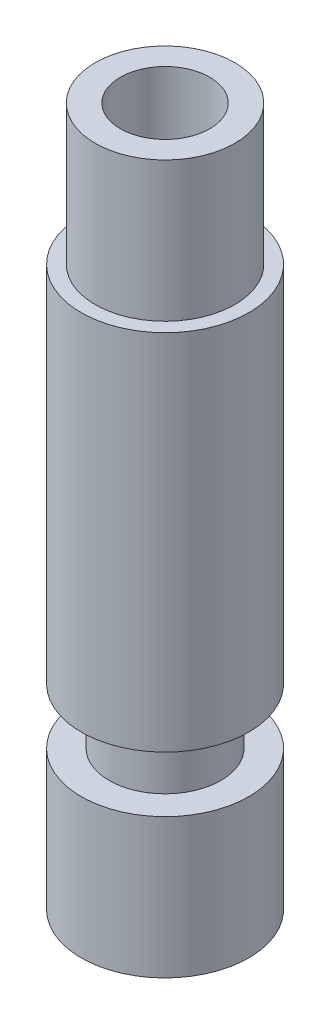
ISO-10303-21;
HEADER;
FILE_DESCRIPTION(('STEP AP214'),'2;1');
FILE_NAME('part.step','',(''),(''),'','','');
FILE_SCHEMA(('AUTOMOTIVE_DESIGN { 1 0 10303 214 1 1 1 1 }'));
ENDSEC;
DATA;
#1=APPLICATION_CONTEXT('core data for automotive mechanical design processes');
#2=APPLICATION_PROTOCOL_DEFINITION('international standard','automotive_design',2000,#1);
#3=PRODUCT_CONTEXT('',#1,'mechanical');
#4=PRODUCT('Part','Part','',(#3));
#5=PRODUCT_RELATED_PRODUCT_CATEGORY('part','',(#4));
#6=PRODUCT_DEFINITION_FORMATION('','',#4);
#7=PRODUCT_DEFINITION_CONTEXT('part definition',#1,'design');
#8=PRODUCT_DEFINITION('design','',#6,#7);
#9=PRODUCT_DEFINITION_SHAPE('','',#8);
#10=(LENGTH_UNIT() NAMED_UNIT(*) SI_UNIT(.MILLI.,.METRE.));
#11=(NAMED_UNIT(*) PLANE_ANGLE_UNIT() SI_UNIT($,.RADIAN.));
#12=(NAMED_UNIT(*) SI_UNIT($,.STERADIAN.) SOLID_ANGLE_UNIT());
#13=UNCERTAINTY_MEASURE_WITH_UNIT(LENGTH_MEASURE(1.E-05),#10,'distance_accuracy_value','');
#14=(GEOMETRIC_REPRESENTATION_CONTEXT(3) GLOBAL_UNCERTAINTY_ASSIGNED_CONTEXT((#13)) GLOBAL_UNIT_ASSIGNED_CONTEXT((#10,
#11,#12)) REPRESENTATION_CONTEXT('',''));
#15=CARTESIAN_POINT('',(0.,0.,0.));
#16=DIRECTION('',(0.,0.,1.));
#17=DIRECTION('',(1.,0.,0.));
#18=AXIS2_PLACEMENT_3D('',#15,#16,#17);
#19=CARTESIAN_POINT('',(3.,0.,0.));
#20=DIRECTION('',(0.,-1.,0.));
#21=DIRECTION('',(0.,0.,-1.));
#22=AXIS2_PLACEMENT_3D('',#19,#20,#21);
#23=PLANE('',#22);
#24=CARTESIAN_POINT('',(0.,0.,0.));
#25=DIRECTION('',(0.,1.,0.));
#26=DIRECTION('',(0.,0.,1.));
#27=AXIS2_PLACEMENT_3D('',#24,#25,#26);
#28=CIRCLE('',#27,1.6);
#29=CARTESIAN_POINT('',(0.,0.,1.6));
#30=VERTEX_POINT('',#29);
#31=EDGE_CURVE('E62',#30,#30,#28,.T.);
#32=ORIENTED_EDGE('',*,*,#31,.T.);
#33=EDGE_LOOP('',(#32));
#34=FACE_BOUND('',#33,.T.);
#35=CARTESIAN_POINT('',(0.,0.,0.));
#36=DIRECTION('',(0.,-1.,0.));
#37=DIRECTION('',(0.,0.,-1.));
#38=AXIS2_PLACEMENT_3D('',#35,#36,#37);
#39=CIRCLE('',#38,3.);
#40=CARTESIAN_POINT('',(0.,0.,-3.));
#41=VERTEX_POINT('',#40);
#42=EDGE_CURVE('E59',#41,#41,#39,.T.);
#43=ORIENTED_EDGE('',*,*,#42,.T.);
#44=EDGE_LOOP('',(#43));
#45=FACE_BOUND('',#44,.T.);
#46=ADVANCED_FACE('F31',(#34,#45),#23,.T.);
#47=CARTESIAN_POINT('',(0.,25.,0.));
#48=DIRECTION('',(0.,1.,0.));
#49=DIRECTION('',(0.,0.,1.));
#50=AXIS2_PLACEMENT_3D('',#47,#48,#49);
#51=PLANE('',#50);
#52=CARTESIAN_POINT('',(0.,25.,0.));
#53=DIRECTION('',(0.,1.,0.));
#54=DIRECTION('',(0.,0.,1.));
#55=AXIS2_PLACEMENT_3D('',#52,#53,#54);
#56=CIRCLE('',#55,1.6);
#57=CARTESIAN_POINT('',(0.,25.,1.6));
#58=VERTEX_POINT('',#57);
#59=EDGE_CURVE('E63',#58,#58,#56,.T.);
#60=ORIENTED_EDGE('',*,*,#59,.F.);
#61=EDGE_LOOP('',(#60));
#62=FACE_BOUND('',#61,.T.);
#63=CARTESIAN_POINT('',(0.,25.,0.));
#64=DIRECTION('',(0.,-1.,0.));
#65=DIRECTION('',(0.,0.,-1.));
#66=AXIS2_PLACEMENT_3D('',#63,#64,#65);
#67=CIRCLE('',#66,2.5);
#68=CARTESIAN_POINT('',(0.,25.,-2.5));
#69=VERTEX_POINT('',#68);
#70=EDGE_CURVE('E10',#69,#69,#67,.T.);
#71=ORIENTED_EDGE('',*,*,#70,.F.);
#72=EDGE_LOOP('',(#71));
#73=FACE_BOUND('',#72,.T.);
#74=ADVANCED_FACE('F78',(#62,#73),#51,.T.);
#75=CARTESIAN_POINT('',(0.,0.,0.));
#76=DIRECTION('',(0.,-1.,0.));
#77=DIRECTION('',(0.,0.,-1.));
#78=AXIS2_PLACEMENT_3D('',#75,#76,#77);
#79=CYLINDRICAL_SURFACE('',#78,2.5);
#80=ORIENTED_EDGE('',*,*,#70,.T.);
#81=EDGE_LOOP('',(#80));
#82=FACE_BOUND('',#81,.T.);
#83=CARTESIAN_POINT('',(0.,20.,0.));
#84=DIRECTION('',(0.,-1.,0.));
#85=DIRECTION('',(0.,0.,-1.));
#86=AXIS2_PLACEMENT_3D('',#83,#84,#85);
#87=CIRCLE('',#86,2.5);
#88=CARTESIAN_POINT('',(0.,20.,-2.5));
#89=VERTEX_POINT('',#88);
#90=EDGE_CURVE('E37',#89,#89,#87,.T.);
#91=ORIENTED_EDGE('',*,*,#90,.F.);
#92=EDGE_LOOP('',(#91));
#93=FACE_BOUND('',#92,.T.);
#94=ADVANCED_FACE('F81',(#82,#93),#79,.T.);
#95=CARTESIAN_POINT('',(2.5,20.,0.));
#96=DIRECTION('',(0.,1.,0.));
#97=DIRECTION('',(0.,0.,1.));
#98=AXIS2_PLACEMENT_3D('',#95,#96,#97);
#99=PLANE('',#98);
#100=ORIENTED_EDGE('',*,*,#90,.T.);
#101=EDGE_LOOP('',(#100));
#102=FACE_BOUND('',#101,.T.);
#103=CARTESIAN_POINT('',(0.,20.,0.));
#104=DIRECTION('',(0.,-1.,0.));
#105=DIRECTION('',(0.,0.,-1.));
#106=AXIS2_PLACEMENT_3D('',#103,#104,#105);
#107=CIRCLE('',#106,3.);
#108=CARTESIAN_POINT('',(0.,20.,-3.));
#109=VERTEX_POINT('',#108);
#110=EDGE_CURVE('E41',#109,#109,#107,.T.);
#111=ORIENTED_EDGE('',*,*,#110,.F.);
#112=EDGE_LOOP('',(#111));
#113=FACE_BOUND('',#112,.T.);
#114=ADVANCED_FACE('F86',(#102,#113),#99,.T.);
#115=CARTESIAN_POINT('',(0.,0.,0.));
#116=DIRECTION('',(0.,-1.,0.));
#117=DIRECTION('',(0.,0.,-1.));
#118=AXIS2_PLACEMENT_3D('',#115,#116,#117);
#119=CYLINDRICAL_SURFACE('',#118,3.);
#120=ORIENTED_EDGE('',*,*,#110,.T.);
#121=EDGE_LOOP('',(#120));
#122=FACE_BOUND('',#121,.T.);
#123=CARTESIAN_POINT('',(0.,7.,0.));
#124=DIRECTION('',(0.,-1.,0.));
#125=DIRECTION('',(0.,0.,-1.));
#126=AXIS2_PLACEMENT_3D('',#123,#124,#125);
#127=CIRCLE('',#126,3.);
#128=CARTESIAN_POINT('',(0.,7.,-3.));
#129=VERTEX_POINT('',#128);
#130=EDGE_CURVE('E45',#129,#129,#127,.T.);
#131=ORIENTED_EDGE('',*,*,#130,.F.);
#132=EDGE_LOOP('',(#131));
#133=FACE_BOUND('',#132,.T.);
#134=ADVANCED_FACE('F91',(#122,#133),#119,.T.);
#135=CARTESIAN_POINT('',(3.,7.,0.));
#136=DIRECTION('',(0.,-1.,0.));
#137=DIRECTION('',(0.,0.,-1.));
#138=AXIS2_PLACEMENT_3D('',#135,#136,#137);
#139=PLANE('',#138);
#140=ORIENTED_EDGE('',*,*,#130,.T.);
#141=EDGE_LOOP('',(#140));
#142=FACE_BOUND('',#141,.T.);
#143=CARTESIAN_POINT('',(0.,7.,0.));
#144=DIRECTION('',(0.,-1.,0.));
#145=DIRECTION('',(0.,0.,-1.));
#146=AXIS2_PLACEMENT_3D('',#143,#144,#145);
#147=CIRCLE('',#146,2.);
#148=CARTESIAN_POINT('',(0.,7.,-2.));
#149=VERTEX_POINT('',#148);
#150=EDGE_CURVE('E50',#149,#149,#147,.T.);
#151=ORIENTED_EDGE('',*,*,#150,.F.);
#152=EDGE_LOOP('',(#151));
#153=FACE_BOUND('',#152,.T.);
#154=ADVANCED_FACE('F94',(#142,#153),#139,.T.);
#155=CARTESIAN_POINT('',(0.,0.,0.));
#156=DIRECTION('',(0.,-1.,0.));
#157=DIRECTION('',(0.,0.,-1.));
#158=AXIS2_PLACEMENT_3D('',#155,#156,#157);
#159=CYLINDRICAL_SURFACE('',#158,2.);
#160=ORIENTED_EDGE('',*,*,#150,.T.);
#161=EDGE_LOOP('',(#160));
#162=FACE_BOUND('',#161,.T.);
#163=CARTESIAN_POINT('',(0.,5.,0.));
#164=DIRECTION('',(0.,-1.,0.));
#165=DIRECTION('',(0.,0.,-1.));
#166=AXIS2_PLACEMENT_3D('',#163,#164,#165);
#167=CIRCLE('',#166,2.);
#168=CARTESIAN_POINT('',(0.,5.,-2.));
#169=VERTEX_POINT('',#168);
#170=EDGE_CURVE('E53',#169,#169,#167,.T.);
#171=ORIENTED_EDGE('',*,*,#170,.F.);
#172=EDGE_LOOP('',(#171));
#173=FACE_BOUND('',#172,.T.);
#174=ADVANCED_FACE('F98',(#162,#173),#159,.T.);
#175=CARTESIAN_POINT('',(2.,5.,0.));
#176=DIRECTION('',(0.,1.,0.));
#177=DIRECTION('',(0.,0.,1.));
#178=AXIS2_PLACEMENT_3D('',#175,#176,#177);
#179=PLANE('',#178);
#180=ORIENTED_EDGE('',*,*,#170,.T.);
#181=EDGE_LOOP('',(#180));
#182=FACE_BOUND('',#181,.T.);
#183=CARTESIAN_POINT('',(0.,5.,0.));
#184=DIRECTION('',(0.,-1.,0.));
#185=DIRECTION('',(0.,0.,-1.));
#186=AXIS2_PLACEMENT_3D('',#183,#184,#185);
#187=CIRCLE('',#186,3.);
#188=CARTESIAN_POINT('',(0.,5.,-3.));
#189=VERTEX_POINT('',#188);
#190=EDGE_CURVE('E56',#189,#189,#187,.T.);
#191=ORIENTED_EDGE('',*,*,#190,.F.);
#192=EDGE_LOOP('',(#191));
#193=FACE_BOUND('',#192,.T.);
#194=ADVANCED_FACE('F102',(#182,#193),#179,.T.);
#195=CARTESIAN_POINT('',(0.,0.,0.));
#196=DIRECTION('',(0.,-1.,0.));
#197=DIRECTION('',(0.,0.,-1.));
#198=AXIS2_PLACEMENT_3D('',#195,#196,#197);
#199=CYLINDRICAL_SURFACE('',#198,3.);
#200=ORIENTED_EDGE('',*,*,#190,.T.);
#201=EDGE_LOOP('',(#200));
#202=FACE_BOUND('',#201,.T.);
#203=ORIENTED_EDGE('',*,*,#42,.F.);
#204=EDGE_LOOP('',(#203));
#205=FACE_BOUND('',#204,.T.);
#206=ADVANCED_FACE('F74',(#202,#205),#199,.T.);
#207=CARTESIAN_POINT('',(0.,0.,0.));
#208=DIRECTION('',(0.,1.,0.));
#209=DIRECTION('',(0.,0.,1.));
#210=AXIS2_PLACEMENT_3D('',#207,#208,#209);
#211=CYLINDRICAL_SURFACE('',#210,1.6);
#212=ORIENTED_EDGE('',*,*,#31,.F.);
#213=EDGE_LOOP('',(#212));
#214=FACE_BOUND('',#213,.T.);
#215=ORIENTED_EDGE('',*,*,#59,.T.);
#216=EDGE_LOOP('',(#215));
#217=FACE_BOUND('',#216,.T.);
#218=ADVANCED_FACE('F71',(#214,#217),#211,.F.);
#219=CLOSED_SHELL('',(#46,#74,#94,#114,#134,#154,#174,#194,#206,#218));
#220=MANIFOLD_SOLID_BREP('B2',#219);
#221=ADVANCED_BREP_SHAPE_REPRESENTATION('',(#18,#220),#14);
#222=SHAPE_DEFINITION_REPRESENTATION(#9,#221);
ENDSEC;
END-ISO-10303-21;
